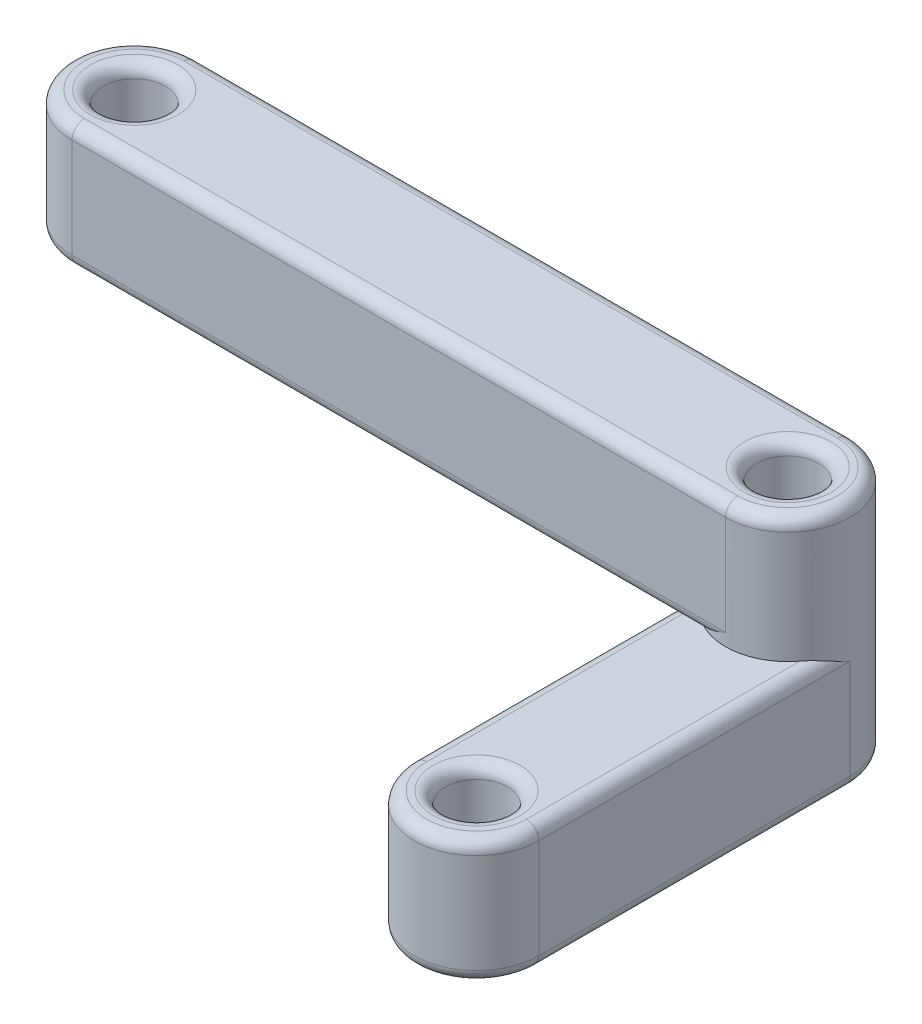
ISO-10303-21;
HEADER;
FILE_DESCRIPTION(('STEP AP214'),'2;1');
FILE_NAME('part.step','',(''),(''),'','','');
FILE_SCHEMA(('AUTOMOTIVE_DESIGN { 1 0 10303 214 1 1 1 1 }'));
ENDSEC;
DATA;
#1=APPLICATION_CONTEXT('core data for automotive mechanical design processes');
#2=APPLICATION_PROTOCOL_DEFINITION('international standard','automotive_design',2000,#1);
#3=PRODUCT_CONTEXT('',#1,'mechanical');
#4=PRODUCT('Part','Part','',(#3));
#5=PRODUCT_RELATED_PRODUCT_CATEGORY('part','',(#4));
#6=PRODUCT_DEFINITION_FORMATION('','',#4);
#7=PRODUCT_DEFINITION_CONTEXT('part definition',#1,'design');
#8=PRODUCT_DEFINITION('design','',#6,#7);
#9=PRODUCT_DEFINITION_SHAPE('','',#8);
#10=(LENGTH_UNIT() NAMED_UNIT(*) SI_UNIT(.MILLI.,.METRE.));
#11=(NAMED_UNIT(*) PLANE_ANGLE_UNIT() SI_UNIT($,.RADIAN.));
#12=(NAMED_UNIT(*) SI_UNIT($,.STERADIAN.) SOLID_ANGLE_UNIT());
#13=UNCERTAINTY_MEASURE_WITH_UNIT(LENGTH_MEASURE(1.E-05),#10,'distance_accuracy_value','');
#14=(GEOMETRIC_REPRESENTATION_CONTEXT(3) GLOBAL_UNCERTAINTY_ASSIGNED_CONTEXT((#13)) GLOBAL_UNIT_ASSIGNED_CONTEXT((#10,
#11,#12)) REPRESENTATION_CONTEXT('',''));
#15=CARTESIAN_POINT('',(0.,0.,0.));
#16=DIRECTION('',(0.,0.,1.));
#17=DIRECTION('',(1.,0.,0.));
#18=AXIS2_PLACEMENT_3D('',#15,#16,#17);
#19=CARTESIAN_POINT('',(0.,10.,0.));
#20=DIRECTION('',(0.,-1.,0.));
#21=DIRECTION('',(0.,0.,-1.));
#22=AXIS2_PLACEMENT_3D('',#19,#20,#21);
#23=CYLINDRICAL_SURFACE('',#22,5.);
#24=DIRECTION('',(0.,-1.,0.));
#25=VECTOR('',#24,1.);
#26=CARTESIAN_POINT('',(0.,10.,-5.));
#27=LINE('',#26,#25);
#28=CARTESIAN_POINT('',(0.,-0.999999999999999,-5.));
#29=VERTEX_POINT('',#28);
#30=CARTESIAN_POINT('',(0.,-9.,-5.));
#31=VERTEX_POINT('',#30);
#32=EDGE_CURVE('E191',#29,#31,#27,.T.);
#33=ORIENTED_EDGE('',*,*,#32,.T.);
#34=CARTESIAN_POINT('',(0.,-9.,0.));
#35=DIRECTION('',(0.,-1.,0.));
#36=DIRECTION('',(0.,0.,-1.));
#37=AXIS2_PLACEMENT_3D('',#34,#35,#36);
#38=CIRCLE('',#37,5.);
#39=CARTESIAN_POINT('',(0.,-9.,5.));
#40=VERTEX_POINT('',#39);
#41=EDGE_CURVE('E254',#31,#40,#38,.F.);
#42=ORIENTED_EDGE('',*,*,#41,.T.);
#43=DIRECTION('',(0.,-1.,0.));
#44=VECTOR('',#43,1.);
#45=CARTESIAN_POINT('',(0.,10.,5.));
#46=LINE('',#45,#44);
#47=CARTESIAN_POINT('',(0.,-0.999999999999999,5.));
#48=VERTEX_POINT('',#47);
#49=EDGE_CURVE('E208',#48,#40,#46,.T.);
#50=ORIENTED_EDGE('',*,*,#49,.F.);
#51=CARTESIAN_POINT('',(0.,-0.999999999999999,0.));
#52=DIRECTION('',(0.,-1.,0.));
#53=DIRECTION('',(0.,0.,-1.));
#54=AXIS2_PLACEMENT_3D('',#51,#52,#53);
#55=CIRCLE('',#54,5.);
#56=EDGE_CURVE('E250',#48,#29,#55,.T.);
#57=ORIENTED_EDGE('',*,*,#56,.T.);
#58=EDGE_LOOP('',(#33,#42,#50,#57));
#59=FACE_BOUND('',#58,.T.);
#60=ADVANCED_FACE('F41',(#59),#23,.T.);
#61=CARTESIAN_POINT('',(0.,10.,5.));
#62=DIRECTION('',(0.,0.,-1.));
#63=DIRECTION('',(-1.,0.,0.));
#64=AXIS2_PLACEMENT_3D('',#61,#62,#63);
#65=PLANE('',#64);
#66=ORIENTED_EDGE('',*,*,#49,.T.);
#67=DIRECTION('',(1.,0.,0.));
#68=VECTOR('',#67,1.);
#69=CARTESIAN_POINT('',(47.5,-9.,5.));
#70=LINE('',#69,#68);
#71=CARTESIAN_POINT('',(52.5,-9.,5.));
#72=VERTEX_POINT('',#71);
#73=EDGE_CURVE('E234',#40,#72,#70,.T.);
#74=ORIENTED_EDGE('',*,*,#73,.T.);
#75=DIRECTION('',(0.,-1.,0.));
#76=VECTOR('',#75,1.);
#77=CARTESIAN_POINT('',(52.5,10.,5.));
#78=LINE('',#77,#76);
#79=CARTESIAN_POINT('',(52.5,-0.999999999999999,5.));
#80=VERTEX_POINT('',#79);
#81=EDGE_CURVE('E205',#80,#72,#78,.T.);
#82=ORIENTED_EDGE('',*,*,#81,.F.);
#83=DIRECTION('',(-1.,0.,0.));
#84=VECTOR('',#83,1.);
#85=CARTESIAN_POINT('',(0.,-0.999999999999999,5.));
#86=LINE('',#85,#84);
#87=EDGE_CURVE('E231',#80,#48,#86,.T.);
#88=ORIENTED_EDGE('',*,*,#87,.T.);
#89=EDGE_LOOP('',(#66,#74,#82,#88));
#90=FACE_BOUND('',#89,.T.);
#91=ADVANCED_FACE('F453',(#90),#65,.F.);
#92=CARTESIAN_POINT('',(52.5,10.,0.));
#93=DIRECTION('',(0.,-1.,0.));
#94=DIRECTION('',(0.,0.,-1.));
#95=AXIS2_PLACEMENT_3D('',#92,#93,#94);
#96=CYLINDRICAL_SURFACE('',#95,5.);
#97=DIRECTION('',(0.,-1.,0.));
#98=VECTOR('',#97,1.);
#99=CARTESIAN_POINT('',(52.5,10.,-5.));
#100=LINE('',#99,#98);
#101=CARTESIAN_POINT('',(52.5,-0.999999999999999,-5.));
#102=VERTEX_POINT('',#101);
#103=CARTESIAN_POINT('',(52.5,-9.,-5.));
#104=VERTEX_POINT('',#103);
#105=EDGE_CURVE('E201',#102,#104,#100,.T.);
#106=ORIENTED_EDGE('',*,*,#105,.F.);
#107=CARTESIAN_POINT('',(52.5,-0.999999999999999,0.));
#108=DIRECTION('',(0.,-1.,0.));
#109=DIRECTION('',(0.,0.,-1.));
#110=AXIS2_PLACEMENT_3D('',#107,#108,#109);
#111=CIRCLE('',#110,5.);
#112=EDGE_CURVE('E287',#102,#80,#111,.T.);
#113=ORIENTED_EDGE('',*,*,#112,.T.);
#114=ORIENTED_EDGE('',*,*,#81,.T.);
#115=CARTESIAN_POINT('',(49.500003091071,-10.,4.00000231830322));
#116=CARTESIAN_POINT('',(49.5630585647057,-9.99996272786149,4.04730692973242));
#117=CARTESIAN_POINT('',(49.6271781454458,-9.99664729599901,4.09305400833086));
#118=CARTESIAN_POINT('',(49.757021489187,-9.98446376305326,4.18117020842976));
#119=CARTESIAN_POINT('',(49.8227419706602,-9.97560623036447,4.22354558656004));
#120=CARTESIAN_POINT('',(49.9550565624563,-9.95340982693486,4.30456158744724));
#121=CARTESIAN_POINT('',(50.0216417483339,-9.94010169512474,4.34322554839961));
#122=CARTESIAN_POINT('',(50.155890463288,-9.90972575771651,4.4171285787088));
#123=CARTESIAN_POINT('',(50.2235546737486,-9.89265548150966,4.45236537541986));
#124=CARTESIAN_POINT('',(50.4030754442915,-9.84352946572384,4.5407413374118));
#125=CARTESIAN_POINT('',(50.5156429908207,-9.80885192026074,4.59099691212811));
#126=CARTESIAN_POINT('',(50.7423506127327,-9.73330715695881,4.68248076028789));
#127=CARTESIAN_POINT('',(50.8564913348248,-9.69243732012404,4.72370519592973));
#128=CARTESIAN_POINT('',(51.0863120417296,-9.60598585396087,4.7975105358491));
#129=CARTESIAN_POINT('',(51.2019962848469,-9.56038652930071,4.83005722377178));
#130=CARTESIAN_POINT('',(51.4340797417778,-9.46594885133827,4.88651951133928));
#131=CARTESIAN_POINT('',(51.5504787132443,-9.41711154627759,4.91043788825951));
#132=CARTESIAN_POINT('',(51.8034830163676,-9.3088434603078,4.95318005463493));
#133=CARTESIAN_POINT('',(51.9401793477205,-9.24901704013445,4.97046013645096));
#134=CARTESIAN_POINT('',(52.2136297726992,-9.12804885770933,4.99367359907178));
#135=CARTESIAN_POINT('',(52.3503831577847,-9.0669100826837,4.99963045205147));
#136=CARTESIAN_POINT('',(52.4913934138853,-9.00384898146073,4.9999944415563));
#137=CARTESIAN_POINT('',(52.4956967333581,-9.00192447842628,4.99999999677532));
#138=CARTESIAN_POINT('',(52.5,-9.,5.));
#139=B_SPLINE_CURVE_WITH_KNOTS('',3,(#115,#116,#117,#118,#119,#120,#121,#122,#123,#124,#125,
#126,#127,#128,#129,#130,#131,#132,#133,#134,#135,#136,#137,#138),.UNSPECIFIED.,.F.,.F.,(4,2,2,
2,2,2,2,2,2,2,2,4),(0.,0.236272697059232,0.472096206225482,0.7063234820799,0.940705036294165,
1.32429553672577,1.70804872990629,2.09329340470067,2.47841396629964,2.92860790913655,
3.37786761282333,3.39200975826805),.UNSPECIFIED.);
#140=CARTESIAN_POINT('',(49.5000030910719,-10.,4.00000231830203));
#141=VERTEX_POINT('',#140);
#142=EDGE_CURVE('E171',#72,#141,#139,.F.);
#143=ORIENTED_EDGE('',*,*,#142,.T.);
#144=CARTESIAN_POINT('',(52.5,-10.,0.));
#145=DIRECTION('',(0.,1.,0.));
#146=DIRECTION('',(0.,0.,1.));
#147=AXIS2_PLACEMENT_3D('',#144,#145,#146);
#148=CIRCLE('',#147,5.);
#149=CARTESIAN_POINT('',(56.5,-10.,3.));
#150=VERTEX_POINT('',#149);
#151=EDGE_CURVE('E67',#141,#150,#148,.T.);
#152=ORIENTED_EDGE('',*,*,#151,.T.);
#153=CARTESIAN_POINT('',(56.5,-10.,3.));
#154=CARTESIAN_POINT('',(56.5473045609069,-10.0000371623371,2.93694469530654));
#155=CARTESIAN_POINT('',(56.5930515988321,-10.0033524811115,2.87282528320766));
#156=CARTESIAN_POINT('',(56.6811677355867,-10.0155357840315,2.74298227571179));
#157=CARTESIAN_POINT('',(56.7235430910172,-10.0243931997809,2.67726196184714));
#158=CARTESIAN_POINT('',(56.8045590614737,-10.0465893681849,2.54494770540636));
#159=CARTESIAN_POINT('',(56.843223014705,-10.0598973817613,2.47836268732835));
#160=CARTESIAN_POINT('',(56.9171260446218,-10.0902730823418,2.34411430702213));
#161=CARTESIAN_POINT('',(56.9523628486697,-10.1073432399562,2.27645026340865));
#162=CARTESIAN_POINT('',(57.040738852702,-10.1564689465733,2.09692992286534));
#163=CARTESIAN_POINT('',(57.0909944731759,-10.1911463028468,1.98436263846201));
#164=CARTESIAN_POINT('',(57.1824784458445,-10.2666906947068,1.75765553787566));
#165=CARTESIAN_POINT('',(57.2237029602559,-10.3075603492893,1.64351507498279));
#166=CARTESIAN_POINT('',(57.2975084908041,-10.3940114614077,1.41369488013739));
#167=CARTESIAN_POINT('',(57.3300552903853,-10.4396106144798,1.29801088982785));
#168=CARTESIAN_POINT('',(57.3865178315478,-10.5340479617569,1.0659279349572));
#169=CARTESIAN_POINT('',(57.4104363503651,-10.5828851077276,0.949529212741659));
#170=CARTESIAN_POINT('',(57.4531791346661,-10.691153566795,0.69652380572792));
#171=CARTESIAN_POINT('',(57.4704595596891,-10.7509805574236,0.559826112249049));
#172=CARTESIAN_POINT('',(57.4936734801876,-10.8719499211339,0.286372958720131));
#173=CARTESIAN_POINT('',(57.4996304485303,-10.9330893068729,0.149618207237307));
#174=CARTESIAN_POINT('',(57.4999944415562,-10.9961510185399,0.00860658611443853));
#175=CARTESIAN_POINT('',(57.4999999967752,-10.9980755215741,0.00430326664155501));
#176=CARTESIAN_POINT('',(57.5,-11.,0.));
#177=B_SPLINE_CURVE_WITH_KNOTS('',3,(#153,#154,#155,#156,#157,#158,#159,#160,#161,#162,#163,
#164,#165,#166,#167,#168,#169,#170,#171,#172,#173,#174,#175,#176),.UNSPECIFIED.,.F.,.F.,(4,2,2,
2,2,2,2,2,2,2,2,4),(0.,0.236272200850865,0.472095214354163,0.706321989677946,0.940703043144717,
1.32429275355729,1.70804515619849,2.09328905143225,2.4784088350463,2.92860728181174,
3.37787147131306,3.39201361675778),.UNSPECIFIED.);
#178=CARTESIAN_POINT('',(57.5,-11.,0.));
#179=VERTEX_POINT('',#178);
#180=EDGE_CURVE('E162',#150,#179,#177,.T.);
#181=ORIENTED_EDGE('',*,*,#180,.T.);
#182=DIRECTION('',(0.,1.,0.));
#183=VECTOR('',#182,1.);
#184=CARTESIAN_POINT('',(57.5,-20.,0.));
#185=LINE('',#184,#183);
#186=CARTESIAN_POINT('',(57.5,-19.,0.));
#187=VERTEX_POINT('',#186);
#188=EDGE_CURVE('E473',#187,#179,#185,.T.);
#189=ORIENTED_EDGE('',*,*,#188,.F.);
#190=CARTESIAN_POINT('',(52.5,-19.,0.));
#191=DIRECTION('',(0.,-1.,0.));
#192=DIRECTION('',(0.,0.,-1.));
#193=AXIS2_PLACEMENT_3D('',#190,#191,#192);
#194=CIRCLE('',#193,5.);
#195=CARTESIAN_POINT('',(47.5,-19.,0.));
#196=VERTEX_POINT('',#195);
#197=EDGE_CURVE('E284',#187,#196,#194,.F.);
#198=ORIENTED_EDGE('',*,*,#197,.T.);
#199=DIRECTION('',(0.,1.,0.));
#200=VECTOR('',#199,1.);
#201=CARTESIAN_POINT('',(47.5,-20.,0.));
#202=LINE('',#201,#200);
#203=CARTESIAN_POINT('',(47.5,-11.,0.));
#204=VERTEX_POINT('',#203);
#205=EDGE_CURVE('E187',#196,#204,#202,.T.);
#206=ORIENTED_EDGE('',*,*,#205,.T.);
#207=CARTESIAN_POINT('',(48.4999976821939,-10.,2.99999690959192));
#208=CARTESIAN_POINT('',(48.4526930707756,-10.000037272115,2.93694143599348));
#209=CARTESIAN_POINT('',(48.4069459921859,-10.0033527039532,2.87282185528957));
#210=CARTESIAN_POINT('',(48.3188297921007,-10.0155362368496,2.74297851162058));
#211=CARTESIAN_POINT('',(48.2764544139753,-10.0243937695133,2.67725803018338));
#212=CARTESIAN_POINT('',(48.1954384130946,-10.0465901728925,2.54494343845922));
#213=CARTESIAN_POINT('',(48.1567744521439,-10.0598983046773,2.47835825261752));
#214=CARTESIAN_POINT('',(48.0828714218347,-10.0902742420347,2.34410953773508));
#215=CARTESIAN_POINT('',(48.047634625122,-10.1073445182161,2.27644532731026));
#216=CARTESIAN_POINT('',(47.959258663121,-10.1564705339357,2.09692455685947));
#217=CARTESIAN_POINT('',(47.9090030883949,-10.1911480793582,1.98435701038647));
#218=CARTESIAN_POINT('',(47.8175192402084,-10.2666928425805,1.75764938858617));
#219=CARTESIAN_POINT('',(47.7762948045497,-10.3075626793762,1.64350866654961));
#220=CARTESIAN_POINT('',(47.7024894645894,-10.3940141454634,1.41368795975462));
#221=CARTESIAN_POINT('',(47.6699427766428,-10.4396134700867,1.2980037166916));
#222=CARTESIAN_POINT('',(47.6134804890209,-10.5340511479784,1.06592025986847));
#223=CARTESIAN_POINT('',(47.5895621120703,-10.5828884530052,0.949521288455527));
#224=CARTESIAN_POINT('',(47.5468199455624,-10.6911565390543,0.696516985095275));
#225=CARTESIAN_POINT('',(47.5295398636727,-10.7509829593489,0.559820653449804));
#226=CARTESIAN_POINT('',(47.5063264009537,-10.8719511420303,0.286370227887296));
#227=CARTESIAN_POINT('',(47.5003695479493,-10.933089917191,0.149616842510525));
#228=CARTESIAN_POINT('',(47.5000055584437,-10.9961510185396,0.0086065861148645));
#229=CARTESIAN_POINT('',(47.5000000032247,-10.9980755215739,0.00430326664198846));
#230=CARTESIAN_POINT('',(47.5,-11.,0.));
#231=B_SPLINE_CURVE_WITH_KNOTS('',3,(#207,#208,#209,#210,#211,#212,#213,#214,#215,#216,#217,
#218,#219,#220,#221,#222,#223,#224,#225,#226,#227,#228,#229,#230),.UNSPECIFIED.,.F.,.F.,(4,2,2,
2,2,2,2,2,2,2,2,4),(0.,0.236272696952657,0.472096206012431,0.706323481759676,0.940705035866721,
1.32429553612904,1.70804872914011,2.0932934037672,2.47841396519923,2.928607909002,
3.37786761365079,3.39200975909551),.UNSPECIFIED.);
#232=CARTESIAN_POINT('',(48.4999976821951,-10.,2.99999690959103));
#233=VERTEX_POINT('',#232);
#234=EDGE_CURVE('E373',#204,#233,#231,.F.);
#235=ORIENTED_EDGE('',*,*,#234,.T.);
#236=CARTESIAN_POINT('',(52.5,-10.,0.));
#237=DIRECTION('',(0.,1.,0.));
#238=DIRECTION('',(0.,0.,1.));
#239=AXIS2_PLACEMENT_3D('',#236,#237,#238);
#240=CIRCLE('',#239,5.);
#241=CARTESIAN_POINT('',(49.5,-10.,-4.));
#242=VERTEX_POINT('',#241);
#243=EDGE_CURVE('E59',#242,#233,#240,.T.);
#244=ORIENTED_EDGE('',*,*,#243,.F.);
#245=CARTESIAN_POINT('',(49.5,-10.,-4.));
#246=CARTESIAN_POINT('',(49.5630553046935,-9.99996283766289,-4.04730456090694));
#247=CARTESIAN_POINT('',(49.6271747167924,-9.9966475188885,-4.09305159883218));
#248=CARTESIAN_POINT('',(49.7570177242884,-9.9844642159685,-4.18116773558682));
#249=CARTESIAN_POINT('',(49.8227380381531,-9.97560680021902,-4.22354309101737));
#250=CARTESIAN_POINT('',(49.9550522945939,-9.95341063181508,-4.30455906147386));
#251=CARTESIAN_POINT('',(50.0216373126719,-9.94010261823865,-4.34322301470519));
#252=CARTESIAN_POINT('',(50.155885692978,-9.90972691765818,-4.4171260446219));
#253=CARTESIAN_POINT('',(50.2235497365914,-9.8926567600438,-4.45236284866976));
#254=CARTESIAN_POINT('',(50.4030700771347,-9.84353105342674,-4.54073885270201));
#255=CARTESIAN_POINT('',(50.5156373615379,-9.80885369715323,-4.59099447317587));
#256=CARTESIAN_POINT('',(50.7423444621242,-9.73330930529323,-4.68247844584442));
#257=CARTESIAN_POINT('',(50.8564849250171,-9.69243965071081,-4.72370296025583));
#258=CARTESIAN_POINT('',(51.0863051198625,-9.6059885385923,-4.79750849080412));
#259=CARTESIAN_POINT('',(51.201989110172,-9.56038938552016,-4.83005529038532));
#260=CARTESIAN_POINT('',(51.4340720650428,-9.46595203824321,-4.88651783154781));
#261=CARTESIAN_POINT('',(51.5504707872585,-9.41711489227277,-4.91043635036513));
#262=CARTESIAN_POINT('',(51.8034761942719,-9.30884643320455,-4.9531791346661));
#263=CARTESIAN_POINT('',(51.9401738877502,-9.24901944257477,-4.97045955968912));
#264=CARTESIAN_POINT('',(52.2136270412806,-9.12805007886777,-4.99367348018758));
#265=CARTESIAN_POINT('',(52.3503817927655,-9.06691069313336,-4.99963044853027));
#266=CARTESIAN_POINT('',(52.4913934138857,-9.00384898146051,-4.99999444155623));
#267=CARTESIAN_POINT('',(52.4956967333585,-9.00192447842606,-4.99999999677524));
#268=CARTESIAN_POINT('',(52.5,-9.,-5.));
#269=B_SPLINE_CURVE_WITH_KNOTS('',3,(#245,#246,#247,#248,#249,#250,#251,#252,#253,#254,#255,
#256,#257,#258,#259,#260,#261,#262,#263,#264,#265,#266,#267,#268),.UNSPECIFIED.,.F.,.F.,(4,2,2,
2,2,2,2,2,2,2,2,4),(0.,0.236272200851054,0.472095214354542,0.70632198967815,0.940703043144736,
1.32429275355719,1.70804515619829,2.0932890514322,2.47840883504634,2.92860728181177,
3.37787147131305,3.39201361675777),.UNSPECIFIED.);
#270=EDGE_CURVE('E11',#242,#104,#269,.T.);
#271=ORIENTED_EDGE('',*,*,#270,.T.);
#272=EDGE_LOOP('',(#106,#113,#114,#143,#152,#181,#189,#198,#206,#235,#244,#271));
#273=FACE_BOUND('',#272,.T.);
#274=ADVANCED_FACE('F182',(#273),#96,.T.);
#275=CARTESIAN_POINT('',(0.,10.,-5.));
#276=DIRECTION('',(0.,0.,1.));
#277=DIRECTION('',(1.,0.,0.));
#278=AXIS2_PLACEMENT_3D('',#275,#276,#277);
#279=PLANE('',#278);
#280=ORIENTED_EDGE('',*,*,#32,.F.);
#281=DIRECTION('',(1.,0.,0.));
#282=VECTOR('',#281,1.);
#283=CARTESIAN_POINT('',(0.,-0.999999999999999,-5.));
#284=LINE('',#283,#282);
#285=EDGE_CURVE('E281',#29,#102,#284,.T.);
#286=ORIENTED_EDGE('',*,*,#285,.T.);
#287=ORIENTED_EDGE('',*,*,#105,.T.);
#288=DIRECTION('',(-1.,0.,0.));
#289=VECTOR('',#288,1.);
#290=CARTESIAN_POINT('',(0.,-9.,-5.));
#291=LINE('',#290,#289);
#292=EDGE_CURVE('E278',#104,#31,#291,.T.);
#293=ORIENTED_EDGE('',*,*,#292,.T.);
#294=EDGE_LOOP('',(#280,#286,#287,#293));
#295=FACE_BOUND('',#294,.T.);
#296=ADVANCED_FACE('F587',(#295),#279,.F.);
#297=CARTESIAN_POINT('',(0.,10.,0.));
#298=DIRECTION('',(0.,-1.,0.));
#299=DIRECTION('',(0.,0.,-1.));
#300=AXIS2_PLACEMENT_3D('',#297,#298,#299);
#301=CYLINDRICAL_SURFACE('',#300,2.5);
#302=CARTESIAN_POINT('',(0.,-0.999999999999999,0.));
#303=DIRECTION('',(0.,-1.,0.));
#304=DIRECTION('',(0.,0.,-1.));
#305=AXIS2_PLACEMENT_3D('',#302,#303,#304);
#306=CIRCLE('',#305,2.5);
#307=CARTESIAN_POINT('',(0.,-0.999999999999999,-2.5));
#308=VERTEX_POINT('',#307);
#309=EDGE_CURVE('E302',#308,#308,#306,.F.);
#310=ORIENTED_EDGE('',*,*,#309,.T.);
#311=EDGE_LOOP('',(#310));
#312=FACE_BOUND('',#311,.T.);
#313=CARTESIAN_POINT('',(0.,-9.,0.));
#314=DIRECTION('',(0.,-1.,0.));
#315=DIRECTION('',(0.,0.,-1.));
#316=AXIS2_PLACEMENT_3D('',#313,#314,#315);
#317=CIRCLE('',#316,2.5);
#318=CARTESIAN_POINT('',(0.,-9.,-2.5));
#319=VERTEX_POINT('',#318);
#320=EDGE_CURVE('E298',#319,#319,#317,.T.);
#321=ORIENTED_EDGE('',*,*,#320,.T.);
#322=EDGE_LOOP('',(#321));
#323=FACE_BOUND('',#322,.T.);
#324=ADVANCED_FACE('F584',(#312,#323),#301,.F.);
#325=CARTESIAN_POINT('',(52.5,10.,0.));
#326=DIRECTION('',(0.,-1.,0.));
#327=DIRECTION('',(0.,0.,-1.));
#328=AXIS2_PLACEMENT_3D('',#325,#326,#327);
#329=CYLINDRICAL_SURFACE('',#328,2.5);
#330=CARTESIAN_POINT('',(52.5,-0.999999999999999,0.));
#331=DIRECTION('',(0.,-1.,0.));
#332=DIRECTION('',(0.,0.,-1.));
#333=AXIS2_PLACEMENT_3D('',#330,#331,#332);
#334=CIRCLE('',#333,2.5);
#335=CARTESIAN_POINT('',(52.5,-0.999999999999999,-2.5));
#336=VERTEX_POINT('',#335);
#337=EDGE_CURVE('E294',#336,#336,#334,.F.);
#338=ORIENTED_EDGE('',*,*,#337,.T.);
#339=EDGE_LOOP('',(#338));
#340=FACE_BOUND('',#339,.T.);
#341=CARTESIAN_POINT('',(52.5,-19.,0.));
#342=DIRECTION('',(0.,-1.,0.));
#343=DIRECTION('',(0.,0.,-1.));
#344=AXIS2_PLACEMENT_3D('',#341,#342,#343);
#345=CIRCLE('',#344,2.5);
#346=CARTESIAN_POINT('',(52.5,-19.,-2.5));
#347=VERTEX_POINT('',#346);
#348=EDGE_CURVE('E290',#347,#347,#345,.T.);
#349=ORIENTED_EDGE('',*,*,#348,.T.);
#350=EDGE_LOOP('',(#349));
#351=FACE_BOUND('',#350,.T.);
#352=ADVANCED_FACE('F580',(#340,#351),#329,.F.);
#353=CARTESIAN_POINT('',(0.,-10.,0.));
#354=DIRECTION('',(0.,-1.,0.));
#355=DIRECTION('',(0.,0.,1.));
#356=AXIS2_PLACEMENT_3D('',#353,#354,#355);
#357=PLANE('',#356);
#358=CARTESIAN_POINT('',(0.,-10.,0.));
#359=DIRECTION('',(0.,-1.,0.));
#360=DIRECTION('',(0.,0.,-1.));
#361=AXIS2_PLACEMENT_3D('',#358,#359,#360);
#362=CIRCLE('',#361,3.5);
#363=CARTESIAN_POINT('',(0.,-10.,-3.5));
#364=VERTEX_POINT('',#363);
#365=EDGE_CURVE('E237',#364,#364,#362,.F.);
#366=ORIENTED_EDGE('',*,*,#365,.T.);
#367=EDGE_LOOP('',(#366));
#368=FACE_BOUND('',#367,.T.);
#369=ORIENTED_EDGE('',*,*,#243,.T.);
#370=DIRECTION('',(0.,0.,1.));
#371=VECTOR('',#370,1.);
#372=CARTESIAN_POINT('',(48.5,-10.,3.49999845479596));
#373=LINE('',#372,#371);
#374=CARTESIAN_POINT('',(48.5,-10.,4.00000299663557));
#375=VERTEX_POINT('',#374);
#376=EDGE_CURVE('E51',#233,#375,#373,.T.);
#377=ORIENTED_EDGE('',*,*,#376,.T.);
#378=DIRECTION('',(1.,0.,0.));
#379=VECTOR('',#378,1.);
#380=CARTESIAN_POINT('',(0.,-10.,4.));
#381=LINE('',#380,#379);
#382=CARTESIAN_POINT('',(0.,-10.,4.));
#383=VERTEX_POINT('',#382);
#384=EDGE_CURVE('E247',#375,#383,#381,.F.);
#385=ORIENTED_EDGE('',*,*,#384,.T.);
#386=CARTESIAN_POINT('',(0.,-10.,0.));
#387=DIRECTION('',(0.,-1.,0.));
#388=DIRECTION('',(0.,0.,-1.));
#389=AXIS2_PLACEMENT_3D('',#386,#387,#388);
#390=CIRCLE('',#389,4.);
#391=CARTESIAN_POINT('',(0.,-10.,-4.));
#392=VERTEX_POINT('',#391);
#393=EDGE_CURVE('E244',#383,#392,#390,.T.);
#394=ORIENTED_EDGE('',*,*,#393,.T.);
#395=DIRECTION('',(-1.,0.,0.));
#396=VECTOR('',#395,1.);
#397=CARTESIAN_POINT('',(52.5,-10.,-4.));
#398=LINE('',#397,#396);
#399=EDGE_CURVE('E241',#392,#242,#398,.F.);
#400=ORIENTED_EDGE('',*,*,#399,.T.);
#401=EDGE_LOOP('',(#369,#377,#385,#394,#400));
#402=FACE_BOUND('',#401,.T.);
#403=ADVANCED_FACE('F567',(#368,#402),#357,.T.);
#404=CARTESIAN_POINT('',(52.5,-10.,0.));
#405=DIRECTION('',(0.,-1.,0.));
#406=DIRECTION('',(0.,0.,1.));
#407=AXIS2_PLACEMENT_3D('',#404,#405,#406);
#408=PLANE('',#407);
#409=CARTESIAN_POINT('',(52.5,-10.,25.));
#410=DIRECTION('',(0.,-1.,0.));
#411=DIRECTION('',(0.,0.,-1.));
#412=AXIS2_PLACEMENT_3D('',#409,#410,#411);
#413=CIRCLE('',#412,3.5);
#414=CARTESIAN_POINT('',(52.5,-10.,21.5));
#415=VERTEX_POINT('',#414);
#416=EDGE_CURVE('E212',#415,#415,#413,.T.);
#417=ORIENTED_EDGE('',*,*,#416,.T.);
#418=EDGE_LOOP('',(#417));
#419=FACE_BOUND('',#418,.T.);
#420=CARTESIAN_POINT('',(52.5,-10.,25.));
#421=DIRECTION('',(0.,-1.,0.));
#422=DIRECTION('',(0.,0.,-1.));
#423=AXIS2_PLACEMENT_3D('',#420,#421,#422);
#424=CIRCLE('',#423,3.99999999999999);
#425=CARTESIAN_POINT('',(48.5,-10.,25.));
#426=VERTEX_POINT('',#425);
#427=CARTESIAN_POINT('',(56.5,-10.,25.));
#428=VERTEX_POINT('',#427);
#429=EDGE_CURVE('E176',#426,#428,#424,.F.);
#430=ORIENTED_EDGE('',*,*,#429,.T.);
#431=DIRECTION('',(0.,0.,-1.));
#432=VECTOR('',#431,1.);
#433=CARTESIAN_POINT('',(56.5,-10.,0.));
#434=LINE('',#433,#432);
#435=EDGE_CURVE('E165',#428,#150,#434,.T.);
#436=ORIENTED_EDGE('',*,*,#435,.T.);
#437=ORIENTED_EDGE('',*,*,#151,.F.);
#438=DIRECTION('',(-1.,0.,0.));
#439=VECTOR('',#438,1.);
#440=CARTESIAN_POINT('',(49.0000015455355,-10.,4.));
#441=LINE('',#440,#439);
#442=EDGE_CURVE('E380',#141,#375,#441,.T.);
#443=ORIENTED_EDGE('',*,*,#442,.T.);
#444=DIRECTION('',(0.,0.,1.));
#445=VECTOR('',#444,1.);
#446=CARTESIAN_POINT('',(48.5,-10.,0.));
#447=LINE('',#446,#445);
#448=EDGE_CURVE('E216',#375,#426,#447,.T.);
#449=ORIENTED_EDGE('',*,*,#448,.T.);
#450=EDGE_LOOP('',(#430,#436,#437,#443,#449));
#451=FACE_BOUND('',#450,.T.);
#452=ADVANCED_FACE('F174',(#419,#451),#408,.F.);
#453=CARTESIAN_POINT('',(52.5,-20.,0.));
#454=DIRECTION('',(0.,-1.,0.));
#455=DIRECTION('',(0.,0.,1.));
#456=AXIS2_PLACEMENT_3D('',#453,#454,#455);
#457=PLANE('',#456);
#458=CARTESIAN_POINT('',(52.5,-20.,25.));
#459=DIRECTION('',(0.,-1.,0.));
#460=DIRECTION('',(0.,0.,-1.));
#461=AXIS2_PLACEMENT_3D('',#458,#459,#460);
#462=CIRCLE('',#461,3.5);
#463=CARTESIAN_POINT('',(52.5,-20.,21.5));
#464=VERTEX_POINT('',#463);
#465=EDGE_CURVE('E323',#464,#464,#462,.F.);
#466=ORIENTED_EDGE('',*,*,#465,.T.);
#467=EDGE_LOOP('',(#466));
#468=FACE_BOUND('',#467,.T.);
#469=CARTESIAN_POINT('',(52.5,-20.,25.));
#470=DIRECTION('',(0.,-1.,0.));
#471=DIRECTION('',(0.,0.,-1.));
#472=AXIS2_PLACEMENT_3D('',#469,#470,#471);
#473=CIRCLE('',#472,3.99999999999999);
#474=CARTESIAN_POINT('',(56.5,-20.,25.));
#475=VERTEX_POINT('',#474);
#476=CARTESIAN_POINT('',(48.5,-20.,25.));
#477=VERTEX_POINT('',#476);
#478=EDGE_CURVE('E316',#475,#477,#473,.T.);
#479=ORIENTED_EDGE('',*,*,#478,.T.);
#480=DIRECTION('',(0.,0.,1.));
#481=VECTOR('',#480,1.);
#482=CARTESIAN_POINT('',(48.5,-20.,0.));
#483=LINE('',#482,#481);
#484=CARTESIAN_POINT('',(48.5,-20.,0.));
#485=VERTEX_POINT('',#484);
#486=EDGE_CURVE('E319',#477,#485,#483,.F.);
#487=ORIENTED_EDGE('',*,*,#486,.T.);
#488=CARTESIAN_POINT('',(52.5,-20.,0.));
#489=DIRECTION('',(0.,-1.,0.));
#490=DIRECTION('',(0.,0.,-1.));
#491=AXIS2_PLACEMENT_3D('',#488,#489,#490);
#492=CIRCLE('',#491,4.);
#493=CARTESIAN_POINT('',(56.5,-20.,0.));
#494=VERTEX_POINT('',#493);
#495=EDGE_CURVE('E310',#485,#494,#492,.T.);
#496=ORIENTED_EDGE('',*,*,#495,.T.);
#497=DIRECTION('',(0.,0.,-1.));
#498=VECTOR('',#497,1.);
#499=CARTESIAN_POINT('',(56.5,-20.,25.));
#500=LINE('',#499,#498);
#501=EDGE_CURVE('E313',#494,#475,#500,.F.);
#502=ORIENTED_EDGE('',*,*,#501,.T.);
#503=EDGE_LOOP('',(#479,#487,#496,#502));
#504=FACE_BOUND('',#503,.T.);
#505=CARTESIAN_POINT('',(52.5,-20.,0.));
#506=DIRECTION('',(0.,-1.,0.));
#507=DIRECTION('',(0.,0.,-1.));
#508=AXIS2_PLACEMENT_3D('',#505,#506,#507);
#509=CIRCLE('',#508,3.5);
#510=CARTESIAN_POINT('',(52.5,-20.,-3.5));
#511=VERTEX_POINT('',#510);
#512=EDGE_CURVE('E306',#511,#511,#509,.F.);
#513=ORIENTED_EDGE('',*,*,#512,.T.);
#514=EDGE_LOOP('',(#513));
#515=FACE_BOUND('',#514,.T.);
#516=ADVANCED_FACE('F555',(#468,#504,#515),#457,.T.);
#517=CARTESIAN_POINT('',(47.5,-20.,0.));
#518=DIRECTION('',(1.,0.,0.));
#519=DIRECTION('',(0.,0.,-1.));
#520=AXIS2_PLACEMENT_3D('',#517,#518,#519);
#521=PLANE('',#520);
#522=ORIENTED_EDGE('',*,*,#205,.F.);
#523=DIRECTION('',(0.,0.,1.));
#524=VECTOR('',#523,1.);
#525=CARTESIAN_POINT('',(47.5,-19.,25.));
#526=LINE('',#525,#524);
#527=CARTESIAN_POINT('',(47.5,-19.,25.));
#528=VERTEX_POINT('',#527);
#529=EDGE_CURVE('E172',#196,#528,#526,.T.);
#530=ORIENTED_EDGE('',*,*,#529,.T.);
#531=DIRECTION('',(0.,1.,0.));
#532=VECTOR('',#531,1.);
#533=CARTESIAN_POINT('',(47.5,-20.,25.));
#534=LINE('',#533,#532);
#535=CARTESIAN_POINT('',(47.5,-11.,25.));
#536=VERTEX_POINT('',#535);
#537=EDGE_CURVE('E194',#528,#536,#534,.T.);
#538=ORIENTED_EDGE('',*,*,#537,.T.);
#539=DIRECTION('',(0.,0.,1.));
#540=VECTOR('',#539,1.);
#541=CARTESIAN_POINT('',(47.5,-11.,0.));
#542=LINE('',#541,#540);
#543=EDGE_CURVE('E335',#536,#204,#542,.F.);
#544=ORIENTED_EDGE('',*,*,#543,.T.);
#545=EDGE_LOOP('',(#522,#530,#538,#544));
#546=FACE_BOUND('',#545,.T.);
#547=ADVANCED_FACE('F540',(#546),#521,.F.);
#548=CARTESIAN_POINT('',(52.5,-20.,25.));
#549=DIRECTION('',(0.,1.,0.));
#550=DIRECTION('',(0.,0.,-1.));
#551=AXIS2_PLACEMENT_3D('',#548,#549,#550);
#552=CYLINDRICAL_SURFACE('',#551,4.99999999999999);
#553=DIRECTION('',(0.,1.,0.));
#554=VECTOR('',#553,1.);
#555=CARTESIAN_POINT('',(57.5,-20.,25.));
#556=LINE('',#555,#554);
#557=CARTESIAN_POINT('',(57.5,-19.,25.));
#558=VERTEX_POINT('',#557);
#559=CARTESIAN_POINT('',(57.5,-11.,25.));
#560=VERTEX_POINT('',#559);
#561=EDGE_CURVE('E536',#558,#560,#556,.T.);
#562=ORIENTED_EDGE('',*,*,#561,.T.);
#563=CARTESIAN_POINT('',(52.5,-11.,25.));
#564=DIRECTION('',(0.,-1.,0.));
#565=DIRECTION('',(0.,0.,-1.));
#566=AXIS2_PLACEMENT_3D('',#563,#564,#565);
#567=CIRCLE('',#566,4.99999999999999);
#568=EDGE_CURVE('E228',#560,#536,#567,.T.);
#569=ORIENTED_EDGE('',*,*,#568,.T.);
#570=ORIENTED_EDGE('',*,*,#537,.F.);
#571=CARTESIAN_POINT('',(52.5,-19.,25.));
#572=DIRECTION('',(0.,-1.,0.));
#573=DIRECTION('',(0.,0.,-1.));
#574=AXIS2_PLACEMENT_3D('',#571,#572,#573);
#575=CIRCLE('',#574,4.99999999999999);
#576=EDGE_CURVE('E225',#528,#558,#575,.F.);
#577=ORIENTED_EDGE('',*,*,#576,.T.);
#578=EDGE_LOOP('',(#562,#569,#570,#577));
#579=FACE_BOUND('',#578,.T.);
#580=ADVANCED_FACE('F534',(#579),#552,.T.);
#581=CARTESIAN_POINT('',(57.5,-20.,0.));
#582=DIRECTION('',(-1.,0.,0.));
#583=DIRECTION('',(0.,0.,1.));
#584=AXIS2_PLACEMENT_3D('',#581,#582,#583);
#585=PLANE('',#584);
#586=ORIENTED_EDGE('',*,*,#188,.T.);
#587=DIRECTION('',(0.,0.,-1.));
#588=VECTOR('',#587,1.);
#589=CARTESIAN_POINT('',(57.5,-11.,0.));
#590=LINE('',#589,#588);
#591=EDGE_CURVE('E166',#179,#560,#590,.F.);
#592=ORIENTED_EDGE('',*,*,#591,.T.);
#593=ORIENTED_EDGE('',*,*,#561,.F.);
#594=DIRECTION('',(0.,0.,-1.));
#595=VECTOR('',#594,1.);
#596=CARTESIAN_POINT('',(57.5,-19.,0.));
#597=LINE('',#596,#595);
#598=EDGE_CURVE('E179',#558,#187,#597,.T.);
#599=ORIENTED_EDGE('',*,*,#598,.T.);
#600=EDGE_LOOP('',(#586,#592,#593,#599));
#601=FACE_BOUND('',#600,.T.);
#602=ADVANCED_FACE('F550',(#601),#585,.F.);
#603=CARTESIAN_POINT('',(52.5,-20.,25.));
#604=DIRECTION('',(0.,1.,0.));
#605=DIRECTION('',(0.,0.,-1.));
#606=AXIS2_PLACEMENT_3D('',#603,#604,#605);
#607=CYLINDRICAL_SURFACE('',#606,2.5);
#608=CARTESIAN_POINT('',(52.5,-19.,25.));
#609=DIRECTION('',(0.,-1.,0.));
#610=DIRECTION('',(0.,0.,-1.));
#611=AXIS2_PLACEMENT_3D('',#608,#609,#610);
#612=CIRCLE('',#611,2.5);
#613=CARTESIAN_POINT('',(52.5,-19.,22.5));
#614=VERTEX_POINT('',#613);
#615=EDGE_CURVE('E331',#614,#614,#612,.T.);
#616=ORIENTED_EDGE('',*,*,#615,.T.);
#617=EDGE_LOOP('',(#616));
#618=FACE_BOUND('',#617,.T.);
#619=CARTESIAN_POINT('',(52.5,-11.,25.));
#620=DIRECTION('',(0.,-1.,0.));
#621=DIRECTION('',(0.,0.,-1.));
#622=AXIS2_PLACEMENT_3D('',#619,#620,#621);
#623=CIRCLE('',#622,2.5);
#624=CARTESIAN_POINT('',(52.5,-11.,22.5));
#625=VERTEX_POINT('',#624);
#626=EDGE_CURVE('E327',#625,#625,#623,.F.);
#627=ORIENTED_EDGE('',*,*,#626,.T.);
#628=EDGE_LOOP('',(#627));
#629=FACE_BOUND('',#628,.T.);
#630=ADVANCED_FACE('F571',(#618,#629),#607,.F.);
#631=CARTESIAN_POINT('',(-12.5,0.,39.5131500518673));
#632=DIRECTION('',(0.,-1.,0.));
#633=DIRECTION('',(0.,0.,-1.));
#634=AXIS2_PLACEMENT_3D('',#631,#632,#633);
#635=PLANE('',#634);
#636=DIRECTION('',(1.,0.,0.));
#637=VECTOR('',#636,1.);
#638=CARTESIAN_POINT('',(-12.5,0.,-4.));
#639=LINE('',#638,#637);
#640=CARTESIAN_POINT('',(52.5,0.,-4.));
#641=VERTEX_POINT('',#640);
#642=CARTESIAN_POINT('',(0.,0.,-4.));
#643=VERTEX_POINT('',#642);
#644=EDGE_CURVE('E271',#641,#643,#639,.F.);
#645=ORIENTED_EDGE('',*,*,#644,.T.);
#646=CARTESIAN_POINT('',(0.,0.,0.));
#647=DIRECTION('',(0.,-1.,0.));
#648=DIRECTION('',(0.,0.,-1.));
#649=AXIS2_PLACEMENT_3D('',#646,#647,#648);
#650=CIRCLE('',#649,4.);
#651=CARTESIAN_POINT('',(0.,0.,4.));
#652=VERTEX_POINT('',#651);
#653=EDGE_CURVE('E274',#643,#652,#650,.F.);
#654=ORIENTED_EDGE('',*,*,#653,.T.);
#655=DIRECTION('',(-1.,0.,0.));
#656=VECTOR('',#655,1.);
#657=CARTESIAN_POINT('',(-12.5,0.,4.));
#658=LINE('',#657,#656);
#659=CARTESIAN_POINT('',(52.5,0.,4.));
#660=VERTEX_POINT('',#659);
#661=EDGE_CURVE('E265',#652,#660,#658,.F.);
#662=ORIENTED_EDGE('',*,*,#661,.T.);
#663=CARTESIAN_POINT('',(52.5,0.,0.));
#664=DIRECTION('',(0.,-1.,0.));
#665=DIRECTION('',(0.,0.,-1.));
#666=AXIS2_PLACEMENT_3D('',#663,#664,#665);
#667=CIRCLE('',#666,4.);
#668=EDGE_CURVE('E268',#660,#641,#667,.F.);
#669=ORIENTED_EDGE('',*,*,#668,.T.);
#670=EDGE_LOOP('',(#645,#654,#662,#669));
#671=FACE_BOUND('',#670,.T.);
#672=CARTESIAN_POINT('',(52.5,0.,0.));
#673=DIRECTION('',(0.,-1.,0.));
#674=DIRECTION('',(0.,0.,-1.));
#675=AXIS2_PLACEMENT_3D('',#672,#673,#674);
#676=CIRCLE('',#675,3.5);
#677=CARTESIAN_POINT('',(52.5,0.,-3.5));
#678=VERTEX_POINT('',#677);
#679=EDGE_CURVE('E261',#678,#678,#676,.T.);
#680=ORIENTED_EDGE('',*,*,#679,.T.);
#681=EDGE_LOOP('',(#680));
#682=FACE_BOUND('',#681,.T.);
#683=CARTESIAN_POINT('',(0.,0.,0.));
#684=DIRECTION('',(0.,-1.,0.));
#685=DIRECTION('',(0.,0.,-1.));
#686=AXIS2_PLACEMENT_3D('',#683,#684,#685);
#687=CIRCLE('',#686,3.5);
#688=CARTESIAN_POINT('',(0.,0.,-3.5));
#689=VERTEX_POINT('',#688);
#690=EDGE_CURVE('E257',#689,#689,#687,.T.);
#691=ORIENTED_EDGE('',*,*,#690,.T.);
#692=EDGE_LOOP('',(#691));
#693=FACE_BOUND('',#692,.T.);
#694=ADVANCED_FACE('F395',(#671,#682,#693),#635,.F.);
#695=CARTESIAN_POINT('',(0.,-9.,-4.));
#696=DIRECTION('',(1.,0.,0.));
#697=DIRECTION('',(0.,0.,-1.));
#698=AXIS2_PLACEMENT_3D('',#695,#696,#697);
#699=CYLINDRICAL_SURFACE('',#698,1.);
#700=ORIENTED_EDGE('',*,*,#270,.F.);
#701=ORIENTED_EDGE('',*,*,#399,.F.);
#702=CARTESIAN_POINT('',(0.,-9.,-4.));
#703=DIRECTION('',(-1.,0.,0.));
#704=DIRECTION('',(0.,0.,1.));
#705=AXIS2_PLACEMENT_3D('',#702,#703,#704);
#706=CIRCLE('',#705,1.);
#707=EDGE_CURVE('E468',#31,#392,#706,.T.);
#708=ORIENTED_EDGE('',*,*,#707,.F.);
#709=ORIENTED_EDGE('',*,*,#292,.F.);
#710=EDGE_LOOP('',(#700,#701,#708,#709));
#711=FACE_BOUND('',#710,.T.);
#712=ADVANCED_FACE('F390',(#711),#699,.T.);
#713=CARTESIAN_POINT('',(0.,-9.,0.));
#714=DIRECTION('',(0.,-1.,0.));
#715=DIRECTION('',(0.,0.,-1.));
#716=AXIS2_PLACEMENT_3D('',#713,#714,#715);
#717=TOROIDAL_SURFACE('',#716,4.,1.);
#718=ORIENTED_EDGE('',*,*,#707,.T.);
#719=ORIENTED_EDGE('',*,*,#393,.F.);
#720=CARTESIAN_POINT('',(0.,-9.,4.));
#721=DIRECTION('',(1.,0.,0.));
#722=DIRECTION('',(0.,0.,-1.));
#723=AXIS2_PLACEMENT_3D('',#720,#721,#722);
#724=CIRCLE('',#723,1.);
#725=EDGE_CURVE('E474',#40,#383,#724,.T.);
#726=ORIENTED_EDGE('',*,*,#725,.F.);
#727=ORIENTED_EDGE('',*,*,#41,.F.);
#728=EDGE_LOOP('',(#718,#719,#726,#727));
#729=FACE_BOUND('',#728,.T.);
#730=ADVANCED_FACE('F394',(#729),#717,.T.);
#731=CARTESIAN_POINT('',(0.,-9.,4.));
#732=DIRECTION('',(-1.,0.,0.));
#733=DIRECTION('',(0.,0.,1.));
#734=AXIS2_PLACEMENT_3D('',#731,#732,#733);
#735=CYLINDRICAL_SURFACE('',#734,1.);
#736=ORIENTED_EDGE('',*,*,#384,.F.);
#737=ORIENTED_EDGE('',*,*,#442,.F.);
#738=ORIENTED_EDGE('',*,*,#142,.F.);
#739=ORIENTED_EDGE('',*,*,#73,.F.);
#740=ORIENTED_EDGE('',*,*,#725,.T.);
#741=EDGE_LOOP('',(#736,#737,#738,#739,#740));
#742=FACE_BOUND('',#741,.T.);
#743=ADVANCED_FACE('F368',(#742),#735,.T.);
#744=CARTESIAN_POINT('',(48.5,-11.,0.));
#745=DIRECTION('',(0.,0.,1.));
#746=DIRECTION('',(1.,0.,0.));
#747=AXIS2_PLACEMENT_3D('',#744,#745,#746);
#748=CYLINDRICAL_SURFACE('',#747,1.);
#749=ORIENTED_EDGE('',*,*,#234,.F.);
#750=ORIENTED_EDGE('',*,*,#543,.F.);
#751=CARTESIAN_POINT('',(48.5,-11.,25.));
#752=DIRECTION('',(0.,0.,1.));
#753=DIRECTION('',(1.,0.,0.));
#754=AXIS2_PLACEMENT_3D('',#751,#752,#753);
#755=CIRCLE('',#754,1.);
#756=EDGE_CURVE('E482',#426,#536,#755,.T.);
#757=ORIENTED_EDGE('',*,*,#756,.F.);
#758=ORIENTED_EDGE('',*,*,#448,.F.);
#759=ORIENTED_EDGE('',*,*,#376,.F.);
#760=EDGE_LOOP('',(#749,#750,#757,#758,#759));
#761=FACE_BOUND('',#760,.T.);
#762=ADVANCED_FACE('F364',(#761),#748,.T.);
#763=CARTESIAN_POINT('',(52.5,-11.,25.));
#764=DIRECTION('',(0.,-1.,0.));
#765=DIRECTION('',(0.,0.,-1.));
#766=AXIS2_PLACEMENT_3D('',#763,#764,#765);
#767=TOROIDAL_SURFACE('',#766,3.99999999999999,1.);
#768=ORIENTED_EDGE('',*,*,#756,.T.);
#769=ORIENTED_EDGE('',*,*,#568,.F.);
#770=CARTESIAN_POINT('',(56.5,-11.,25.));
#771=DIRECTION('',(0.,0.,-1.));
#772=DIRECTION('',(-1.,0.,0.));
#773=AXIS2_PLACEMENT_3D('',#770,#771,#772);
#774=CIRCLE('',#773,1.);
#775=EDGE_CURVE('E388',#428,#560,#774,.T.);
#776=ORIENTED_EDGE('',*,*,#775,.F.);
#777=ORIENTED_EDGE('',*,*,#429,.F.);
#778=EDGE_LOOP('',(#768,#769,#776,#777));
#779=FACE_BOUND('',#778,.T.);
#780=ADVANCED_FACE('F361',(#779),#767,.T.);
#781=CARTESIAN_POINT('',(56.5,-11.,0.));
#782=DIRECTION('',(0.,0.,-1.));
#783=DIRECTION('',(-1.,0.,0.));
#784=AXIS2_PLACEMENT_3D('',#781,#782,#783);
#785=CYLINDRICAL_SURFACE('',#784,1.);
#786=ORIENTED_EDGE('',*,*,#775,.T.);
#787=ORIENTED_EDGE('',*,*,#591,.F.);
#788=ORIENTED_EDGE('',*,*,#180,.F.);
#789=ORIENTED_EDGE('',*,*,#435,.F.);
#790=EDGE_LOOP('',(#786,#787,#788,#789));
#791=FACE_BOUND('',#790,.T.);
#792=ADVANCED_FACE('F164',(#791),#785,.T.);
#793=CARTESIAN_POINT('',(52.5,-0.999999999999999,0.));
#794=DIRECTION('',(0.,-1.,0.));
#795=DIRECTION('',(0.,0.,-1.));
#796=AXIS2_PLACEMENT_3D('',#793,#794,#795);
#797=TOROIDAL_SURFACE('',#796,4.,1.);
#798=CARTESIAN_POINT('',(52.5,-1.,-4.));
#799=DIRECTION('',(-1.,0.,0.));
#800=DIRECTION('',(0.,0.,1.));
#801=AXIS2_PLACEMENT_3D('',#798,#799,#800);
#802=CIRCLE('',#801,1.);
#803=EDGE_CURVE('E490',#641,#102,#802,.T.);
#804=ORIENTED_EDGE('',*,*,#803,.F.);
#805=ORIENTED_EDGE('',*,*,#668,.F.);
#806=CARTESIAN_POINT('',(52.5,-0.999999999999999,4.));
#807=DIRECTION('',(-1.,0.,0.));
#808=DIRECTION('',(0.,0.,1.));
#809=AXIS2_PLACEMENT_3D('',#806,#807,#808);
#810=CIRCLE('',#809,1.);
#811=EDGE_CURVE('E493',#80,#660,#810,.T.);
#812=ORIENTED_EDGE('',*,*,#811,.F.);
#813=ORIENTED_EDGE('',*,*,#112,.F.);
#814=EDGE_LOOP('',(#804,#805,#812,#813));
#815=FACE_BOUND('',#814,.T.);
#816=ADVANCED_FACE('F360',(#815),#797,.T.);
#817=CARTESIAN_POINT('',(0.,-0.999999999999999,4.));
#818=DIRECTION('',(-1.,0.,0.));
#819=DIRECTION('',(0.,0.,1.));
#820=AXIS2_PLACEMENT_3D('',#817,#818,#819);
#821=CYLINDRICAL_SURFACE('',#820,1.);
#822=ORIENTED_EDGE('',*,*,#811,.T.);
#823=ORIENTED_EDGE('',*,*,#661,.F.);
#824=CARTESIAN_POINT('',(0.,-0.999999999999999,4.));
#825=DIRECTION('',(-1.,0.,0.));
#826=DIRECTION('',(0.,0.,1.));
#827=AXIS2_PLACEMENT_3D('',#824,#825,#826);
#828=CIRCLE('',#827,1.);
#829=EDGE_CURVE('E498',#48,#652,#828,.T.);
#830=ORIENTED_EDGE('',*,*,#829,.F.);
#831=ORIENTED_EDGE('',*,*,#87,.F.);
#832=EDGE_LOOP('',(#822,#823,#830,#831));
#833=FACE_BOUND('',#832,.T.);
#834=ADVANCED_FACE('F405',(#833),#821,.T.);
#835=CARTESIAN_POINT('',(0.,-0.999999999999999,-4.));
#836=DIRECTION('',(1.,0.,0.));
#837=DIRECTION('',(0.,0.,-1.));
#838=AXIS2_PLACEMENT_3D('',#835,#836,#837);
#839=CYLINDRICAL_SURFACE('',#838,1.);
#840=ORIENTED_EDGE('',*,*,#803,.T.);
#841=ORIENTED_EDGE('',*,*,#285,.F.);
#842=CARTESIAN_POINT('',(0.,-1.,-4.));
#843=DIRECTION('',(-1.,0.,0.));
#844=DIRECTION('',(0.,0.,1.));
#845=AXIS2_PLACEMENT_3D('',#842,#843,#844);
#846=CIRCLE('',#845,1.);
#847=EDGE_CURVE('E503',#643,#29,#846,.T.);
#848=ORIENTED_EDGE('',*,*,#847,.F.);
#849=ORIENTED_EDGE('',*,*,#644,.F.);
#850=EDGE_LOOP('',(#840,#841,#848,#849));
#851=FACE_BOUND('',#850,.T.);
#852=ADVANCED_FACE('F401',(#851),#839,.T.);
#853=CARTESIAN_POINT('',(0.,-0.999999999999999,0.));
#854=DIRECTION('',(0.,-1.,0.));
#855=DIRECTION('',(0.,0.,-1.));
#856=AXIS2_PLACEMENT_3D('',#853,#854,#855);
#857=TOROIDAL_SURFACE('',#856,4.,1.);
#858=ORIENTED_EDGE('',*,*,#829,.T.);
#859=ORIENTED_EDGE('',*,*,#653,.F.);
#860=ORIENTED_EDGE('',*,*,#847,.T.);
#861=ORIENTED_EDGE('',*,*,#56,.F.);
#862=EDGE_LOOP('',(#858,#859,#860,#861));
#863=FACE_BOUND('',#862,.T.);
#864=ADVANCED_FACE('F397',(#863),#857,.T.);
#865=CARTESIAN_POINT('',(52.5,-0.999999999999999,0.));
#866=DIRECTION('',(0.,-1.,0.));
#867=DIRECTION('',(0.,0.,-1.));
#868=AXIS2_PLACEMENT_3D('',#865,#866,#867);
#869=TOROIDAL_SURFACE('',#868,3.5,1.);
#870=ORIENTED_EDGE('',*,*,#337,.F.);
#871=EDGE_LOOP('',(#870));
#872=FACE_BOUND('',#871,.T.);
#873=ORIENTED_EDGE('',*,*,#679,.F.);
#874=EDGE_LOOP('',(#873));
#875=FACE_BOUND('',#874,.T.);
#876=ADVANCED_FACE('F400',(#872,#875),#869,.T.);
#877=CARTESIAN_POINT('',(0.,-0.999999999999999,0.));
#878=DIRECTION('',(0.,-1.,0.));
#879=DIRECTION('',(0.,0.,-1.));
#880=AXIS2_PLACEMENT_3D('',#877,#878,#879);
#881=TOROIDAL_SURFACE('',#880,3.5,1.);
#882=ORIENTED_EDGE('',*,*,#309,.F.);
#883=EDGE_LOOP('',(#882));
#884=FACE_BOUND('',#883,.T.);
#885=ORIENTED_EDGE('',*,*,#690,.F.);
#886=EDGE_LOOP('',(#885));
#887=FACE_BOUND('',#886,.T.);
#888=ADVANCED_FACE('F415',(#884,#887),#881,.T.);
#889=CARTESIAN_POINT('',(52.5,-19.,25.));
#890=DIRECTION('',(0.,-1.,0.));
#891=DIRECTION('',(0.,0.,-1.));
#892=AXIS2_PLACEMENT_3D('',#889,#890,#891);
#893=TOROIDAL_SURFACE('',#892,3.5,1.);
#894=ORIENTED_EDGE('',*,*,#615,.F.);
#895=EDGE_LOOP('',(#894));
#896=FACE_BOUND('',#895,.T.);
#897=ORIENTED_EDGE('',*,*,#465,.F.);
#898=EDGE_LOOP('',(#897));
#899=FACE_BOUND('',#898,.T.);
#900=ADVANCED_FACE('F419',(#896,#899),#893,.T.);
#901=CARTESIAN_POINT('',(56.5,-19.,0.));
#902=DIRECTION('',(0.,0.,1.));
#903=DIRECTION('',(1.,0.,0.));
#904=AXIS2_PLACEMENT_3D('',#901,#902,#903);
#905=CYLINDRICAL_SURFACE('',#904,1.);
#906=CARTESIAN_POINT('',(56.5,-19.,25.));
#907=DIRECTION('',(0.,0.,1.));
#908=DIRECTION('',(1.,0.,0.));
#909=AXIS2_PLACEMENT_3D('',#906,#907,#908);
#910=CIRCLE('',#909,1.);
#911=EDGE_CURVE('E512',#475,#558,#910,.T.);
#912=ORIENTED_EDGE('',*,*,#911,.F.);
#913=ORIENTED_EDGE('',*,*,#501,.F.);
#914=CARTESIAN_POINT('',(56.5,-19.,0.));
#915=DIRECTION('',(0.,0.,-1.));
#916=DIRECTION('',(-1.,0.,0.));
#917=AXIS2_PLACEMENT_3D('',#914,#915,#916);
#918=CIRCLE('',#917,1.);
#919=EDGE_CURVE('E45',#187,#494,#918,.T.);
#920=ORIENTED_EDGE('',*,*,#919,.F.);
#921=ORIENTED_EDGE('',*,*,#598,.F.);
#922=EDGE_LOOP('',(#912,#913,#920,#921));
#923=FACE_BOUND('',#922,.T.);
#924=ADVANCED_FACE('F423',(#923),#905,.T.);
#925=CARTESIAN_POINT('',(52.5,-19.,0.));
#926=DIRECTION('',(0.,-1.,0.));
#927=DIRECTION('',(0.,0.,-1.));
#928=AXIS2_PLACEMENT_3D('',#925,#926,#927);
#929=TOROIDAL_SURFACE('',#928,4.,1.);
#930=ORIENTED_EDGE('',*,*,#919,.T.);
#931=ORIENTED_EDGE('',*,*,#495,.F.);
#932=CARTESIAN_POINT('',(48.5,-19.,0.));
#933=DIRECTION('',(0.,0.,1.));
#934=DIRECTION('',(0.,-1.,0.));
#935=AXIS2_PLACEMENT_3D('',#932,#933,#934);
#936=CIRCLE('',#935,1.);
#937=EDGE_CURVE('E510',#196,#485,#936,.T.);
#938=ORIENTED_EDGE('',*,*,#937,.F.);
#939=ORIENTED_EDGE('',*,*,#197,.F.);
#940=EDGE_LOOP('',(#930,#931,#938,#939));
#941=FACE_BOUND('',#940,.T.);
#942=ADVANCED_FACE('F433',(#941),#929,.T.);
#943=CARTESIAN_POINT('',(52.5,-19.,25.));
#944=DIRECTION('',(0.,-1.,0.));
#945=DIRECTION('',(0.,0.,-1.));
#946=AXIS2_PLACEMENT_3D('',#943,#944,#945);
#947=TOROIDAL_SURFACE('',#946,3.99999999999999,1.);
#948=ORIENTED_EDGE('',*,*,#911,.T.);
#949=ORIENTED_EDGE('',*,*,#576,.F.);
#950=CARTESIAN_POINT('',(48.5,-19.,25.));
#951=DIRECTION('',(0.,0.,-1.));
#952=DIRECTION('',(-1.,0.,0.));
#953=AXIS2_PLACEMENT_3D('',#950,#951,#952);
#954=CIRCLE('',#953,1.);
#955=EDGE_CURVE('E507',#477,#528,#954,.T.);
#956=ORIENTED_EDGE('',*,*,#955,.F.);
#957=ORIENTED_EDGE('',*,*,#478,.F.);
#958=EDGE_LOOP('',(#948,#949,#956,#957));
#959=FACE_BOUND('',#958,.T.);
#960=ADVANCED_FACE('F429',(#959),#947,.T.);
#961=CARTESIAN_POINT('',(48.5,-19.,0.));
#962=DIRECTION('',(0.,0.,-1.));
#963=DIRECTION('',(-1.,0.,0.));
#964=AXIS2_PLACEMENT_3D('',#961,#962,#963);
#965=CYLINDRICAL_SURFACE('',#964,1.);
#966=ORIENTED_EDGE('',*,*,#937,.T.);
#967=ORIENTED_EDGE('',*,*,#486,.F.);
#968=ORIENTED_EDGE('',*,*,#955,.T.);
#969=ORIENTED_EDGE('',*,*,#529,.F.);
#970=EDGE_LOOP('',(#966,#967,#968,#969));
#971=FACE_BOUND('',#970,.T.);
#972=ADVANCED_FACE('F425',(#971),#965,.T.);
#973=CARTESIAN_POINT('',(52.5,-19.,0.));
#974=DIRECTION('',(0.,-1.,0.));
#975=DIRECTION('',(0.,0.,-1.));
#976=AXIS2_PLACEMENT_3D('',#973,#974,#975);
#977=TOROIDAL_SURFACE('',#976,3.5,1.);
#978=ORIENTED_EDGE('',*,*,#348,.F.);
#979=EDGE_LOOP('',(#978));
#980=FACE_BOUND('',#979,.T.);
#981=ORIENTED_EDGE('',*,*,#512,.F.);
#982=EDGE_LOOP('',(#981));
#983=FACE_BOUND('',#982,.T.);
#984=ADVANCED_FACE('F428',(#980,#983),#977,.T.);
#985=CARTESIAN_POINT('',(0.,-9.,0.));
#986=DIRECTION('',(0.,-1.,0.));
#987=DIRECTION('',(0.,0.,-1.));
#988=AXIS2_PLACEMENT_3D('',#985,#986,#987);
#989=TOROIDAL_SURFACE('',#988,3.5,1.);
#990=ORIENTED_EDGE('',*,*,#320,.F.);
#991=EDGE_LOOP('',(#990));
#992=FACE_BOUND('',#991,.T.);
#993=ORIENTED_EDGE('',*,*,#365,.F.);
#994=EDGE_LOOP('',(#993));
#995=FACE_BOUND('',#994,.T.);
#996=ADVANCED_FACE('F442',(#992,#995),#989,.T.);
#997=CARTESIAN_POINT('',(52.5,-11.,25.));
#998=DIRECTION('',(0.,-1.,0.));
#999=DIRECTION('',(0.,0.,-1.));
#1000=AXIS2_PLACEMENT_3D('',#997,#998,#999);
#1001=TOROIDAL_SURFACE('',#1000,3.5,1.);
#1002=ORIENTED_EDGE('',*,*,#416,.F.);
#1003=EDGE_LOOP('',(#1002));
#1004=FACE_BOUND('',#1003,.T.);
#1005=ORIENTED_EDGE('',*,*,#626,.F.);
#1006=EDGE_LOOP('',(#1005));
#1007=FACE_BOUND('',#1006,.T.);
#1008=ADVANCED_FACE('F43',(#1004,#1007),#1001,.T.);
#1009=CLOSED_SHELL('',(#60,#91,#274,#296,#324,#352,#403,#452,#516,#547,#580,#602,#630,#694,#712,
#730,#743,#762,#780,#792,#816,#834,#852,#864,#876,#888,#900,#924,#942,#960,#972,#984,#996,#1008));
#1010=MANIFOLD_SOLID_BREP('B2',#1009);
#1011=ADVANCED_BREP_SHAPE_REPRESENTATION('',(#18,#1010),#14);
#1012=SHAPE_DEFINITION_REPRESENTATION(#9,#1011);
ENDSEC;
END-ISO-10303-21;
